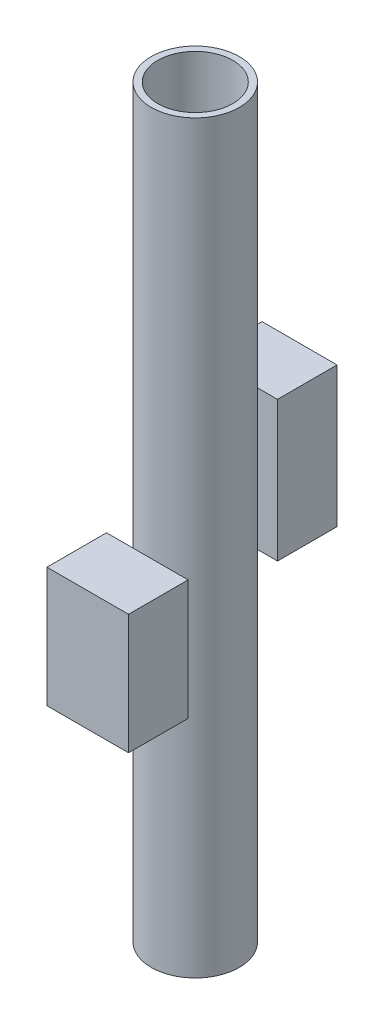
ISO-10303-21;
HEADER;
FILE_DESCRIPTION(('STEP AP214'),'2;1');
FILE_NAME('part.step','',(''),(''),'','','');
FILE_SCHEMA(('AUTOMOTIVE_DESIGN { 1 0 10303 214 1 1 1 1 }'));
ENDSEC;
DATA;
#1=APPLICATION_CONTEXT('core data for automotive mechanical design processes');
#2=APPLICATION_PROTOCOL_DEFINITION('international standard','automotive_design',2000,#1);
#3=PRODUCT_CONTEXT('',#1,'mechanical');
#4=PRODUCT('Part','Part','',(#3));
#5=PRODUCT_RELATED_PRODUCT_CATEGORY('part','',(#4));
#6=PRODUCT_DEFINITION_FORMATION('','',#4);
#7=PRODUCT_DEFINITION_CONTEXT('part definition',#1,'design');
#8=PRODUCT_DEFINITION('design','',#6,#7);
#9=PRODUCT_DEFINITION_SHAPE('','',#8);
#10=(LENGTH_UNIT() NAMED_UNIT(*) SI_UNIT(.MILLI.,.METRE.));
#11=(NAMED_UNIT(*) PLANE_ANGLE_UNIT() SI_UNIT($,.RADIAN.));
#12=(NAMED_UNIT(*) SI_UNIT($,.STERADIAN.) SOLID_ANGLE_UNIT());
#13=UNCERTAINTY_MEASURE_WITH_UNIT(LENGTH_MEASURE(1.E-05),#10,'distance_accuracy_value','');
#14=(GEOMETRIC_REPRESENTATION_CONTEXT(3) GLOBAL_UNCERTAINTY_ASSIGNED_CONTEXT((#13)) GLOBAL_UNIT_ASSIGNED_CONTEXT((#10,
#11,#12)) REPRESENTATION_CONTEXT('',''));
#15=CARTESIAN_POINT('',(0.,0.,0.));
#16=DIRECTION('',(0.,0.,1.));
#17=DIRECTION('',(1.,0.,0.));
#18=AXIS2_PLACEMENT_3D('',#15,#16,#17);
#19=CARTESIAN_POINT('',(-12.5940824496862,156.548087878033,-35.));
#20=DIRECTION('',(-1.,0.,0.));
#21=DIRECTION('',(0.,-1.,0.));
#22=AXIS2_PLACEMENT_3D('',#19,#20,#21);
#23=PLANE('',#22);
#24=DIRECTION('',(0.,-1.,0.));
#25=VECTOR('',#24,1.);
#26=CARTESIAN_POINT('',(-12.5940824496862,156.548087878033,-15.));
#27=LINE('',#26,#25);
#28=CARTESIAN_POINT('',(-12.5940824496862,156.548087878033,-15.));
#29=VERTEX_POINT('',#28);
#30=CARTESIAN_POINT('',(-12.5940824496862,109.530373673697,-15.));
#31=VERTEX_POINT('',#30);
#32=EDGE_CURVE('E108',#29,#31,#27,.T.);
#33=ORIENTED_EDGE('',*,*,#32,.F.);
#34=DIRECTION('',(0.,0.,1.));
#35=VECTOR('',#34,1.);
#36=CARTESIAN_POINT('',(-12.5940824496862,156.548087878033,-35.));
#37=LINE('',#36,#35);
#38=CARTESIAN_POINT('',(-12.5940824496862,156.548087878033,-35.));
#39=VERTEX_POINT('',#38);
#40=EDGE_CURVE('E12',#39,#29,#37,.T.);
#41=ORIENTED_EDGE('',*,*,#40,.F.);
#42=DIRECTION('',(0.,-1.,0.));
#43=VECTOR('',#42,1.);
#44=CARTESIAN_POINT('',(-12.5940824496862,156.548087878033,-35.));
#45=LINE('',#44,#43);
#46=CARTESIAN_POINT('',(-12.5940824496862,109.530373673697,-35.));
#47=VERTEX_POINT('',#46);
#48=EDGE_CURVE('E102',#39,#47,#45,.T.);
#49=ORIENTED_EDGE('',*,*,#48,.T.);
#50=DIRECTION('',(0.,0.,1.));
#51=VECTOR('',#50,1.);
#52=CARTESIAN_POINT('',(-12.5940824496862,109.530373673697,-35.));
#53=LINE('',#52,#51);
#54=EDGE_CURVE('E47',#47,#31,#53,.T.);
#55=ORIENTED_EDGE('',*,*,#54,.T.);
#56=EDGE_LOOP('',(#33,#41,#49,#55));
#57=FACE_BOUND('',#56,.T.);
#58=ADVANCED_FACE('F44',(#57),#23,.T.);
#59=CARTESIAN_POINT('',(12.5940824496862,156.548087878033,-35.));
#60=DIRECTION('',(0.,1.,0.));
#61=DIRECTION('',(0.,0.,1.));
#62=AXIS2_PLACEMENT_3D('',#59,#60,#61);
#63=PLANE('',#62);
#64=DIRECTION('',(-1.,0.,0.));
#65=VECTOR('',#64,1.);
#66=CARTESIAN_POINT('',(12.5940824496862,156.548087878033,-15.));
#67=LINE('',#66,#65);
#68=CARTESIAN_POINT('',(12.5940824496862,156.548087878033,-15.));
#69=VERTEX_POINT('',#68);
#70=EDGE_CURVE('E104',#69,#29,#67,.T.);
#71=ORIENTED_EDGE('',*,*,#70,.F.);
#72=DIRECTION('',(0.,0.,1.));
#73=VECTOR('',#72,1.);
#74=CARTESIAN_POINT('',(12.5940824496862,156.548087878033,-35.));
#75=LINE('',#74,#73);
#76=CARTESIAN_POINT('',(12.5940824496862,156.548087878033,-35.));
#77=VERTEX_POINT('',#76);
#78=EDGE_CURVE('E53',#77,#69,#75,.T.);
#79=ORIENTED_EDGE('',*,*,#78,.F.);
#80=DIRECTION('',(-1.,0.,0.));
#81=VECTOR('',#80,1.);
#82=CARTESIAN_POINT('',(12.5940824496862,156.548087878033,-35.));
#83=LINE('',#82,#81);
#84=EDGE_CURVE('E99',#77,#39,#83,.T.);
#85=ORIENTED_EDGE('',*,*,#84,.T.);
#86=ORIENTED_EDGE('',*,*,#40,.T.);
#87=EDGE_LOOP('',(#71,#79,#85,#86));
#88=FACE_BOUND('',#87,.T.);
#89=ADVANCED_FACE('F118',(#88),#63,.T.);
#90=CARTESIAN_POINT('',(12.5940824496862,109.530373673697,-35.));
#91=DIRECTION('',(1.,0.,0.));
#92=DIRECTION('',(0.,1.,0.));
#93=AXIS2_PLACEMENT_3D('',#90,#91,#92);
#94=PLANE('',#93);
#95=DIRECTION('',(0.,1.,0.));
#96=VECTOR('',#95,1.);
#97=CARTESIAN_POINT('',(12.5940824496862,109.530373673697,-15.));
#98=LINE('',#97,#96);
#99=CARTESIAN_POINT('',(12.5940824496862,109.530373673697,-15.));
#100=VERTEX_POINT('',#99);
#101=EDGE_CURVE('E94',#100,#69,#98,.T.);
#102=ORIENTED_EDGE('',*,*,#101,.F.);
#103=DIRECTION('',(0.,0.,1.));
#104=VECTOR('',#103,1.);
#105=CARTESIAN_POINT('',(12.5940824496862,109.530373673697,-35.));
#106=LINE('',#105,#104);
#107=CARTESIAN_POINT('',(12.5940824496862,109.530373673697,-35.));
#108=VERTEX_POINT('',#107);
#109=EDGE_CURVE('E89',#108,#100,#106,.T.);
#110=ORIENTED_EDGE('',*,*,#109,.F.);
#111=DIRECTION('',(0.,1.,0.));
#112=VECTOR('',#111,1.);
#113=CARTESIAN_POINT('',(12.5940824496862,109.530373673697,-35.));
#114=LINE('',#113,#112);
#115=EDGE_CURVE('E92',#108,#77,#114,.T.);
#116=ORIENTED_EDGE('',*,*,#115,.T.);
#117=ORIENTED_EDGE('',*,*,#78,.T.);
#118=EDGE_LOOP('',(#102,#110,#116,#117));
#119=FACE_BOUND('',#118,.T.);
#120=ADVANCED_FACE('F91',(#119),#94,.T.);
#121=CARTESIAN_POINT('',(-12.5940824496862,109.530373673697,-35.));
#122=DIRECTION('',(0.,-1.,0.));
#123=DIRECTION('',(0.,0.,-1.));
#124=AXIS2_PLACEMENT_3D('',#121,#122,#123);
#125=PLANE('',#124);
#126=DIRECTION('',(1.,0.,0.));
#127=VECTOR('',#126,1.);
#128=CARTESIAN_POINT('',(-12.5940824496862,109.530373673697,-15.));
#129=LINE('',#128,#127);
#130=EDGE_CURVE('E111',#31,#100,#129,.T.);
#131=ORIENTED_EDGE('',*,*,#130,.F.);
#132=ORIENTED_EDGE('',*,*,#54,.F.);
#133=DIRECTION('',(1.,0.,0.));
#134=VECTOR('',#133,1.);
#135=CARTESIAN_POINT('',(-12.5940824496862,109.530373673697,-35.));
#136=LINE('',#135,#134);
#137=EDGE_CURVE('E98',#47,#108,#136,.T.);
#138=ORIENTED_EDGE('',*,*,#137,.T.);
#139=ORIENTED_EDGE('',*,*,#109,.T.);
#140=EDGE_LOOP('',(#131,#132,#138,#139));
#141=FACE_BOUND('',#140,.T.);
#142=ADVANCED_FACE('F101',(#141),#125,.T.);
#143=CARTESIAN_POINT('',(0.,0.,-35.));
#144=DIRECTION('',(0.,0.,1.));
#145=DIRECTION('',(1.,0.,0.));
#146=AXIS2_PLACEMENT_3D('',#143,#144,#145);
#147=PLANE('',#146);
#148=ORIENTED_EDGE('',*,*,#48,.F.);
#149=ORIENTED_EDGE('',*,*,#84,.F.);
#150=ORIENTED_EDGE('',*,*,#115,.F.);
#151=ORIENTED_EDGE('',*,*,#137,.F.);
#152=EDGE_LOOP('',(#148,#149,#150,#151));
#153=FACE_BOUND('',#152,.T.);
#154=ADVANCED_FACE('F97',(#153),#147,.F.);
#155=CARTESIAN_POINT('',(0.,0.,-15.));
#156=DIRECTION('',(0.,0.,1.));
#157=DIRECTION('',(1.,0.,0.));
#158=AXIS2_PLACEMENT_3D('',#155,#156,#157);
#159=PLANE('',#158);
#160=ORIENTED_EDGE('',*,*,#32,.T.);
#161=ORIENTED_EDGE('',*,*,#130,.T.);
#162=ORIENTED_EDGE('',*,*,#101,.T.);
#163=ORIENTED_EDGE('',*,*,#70,.T.);
#164=EDGE_LOOP('',(#160,#161,#162,#163));
#165=FACE_BOUND('',#164,.T.);
#166=ADVANCED_FACE('F117',(#165),#159,.T.);
#167=CLOSED_SHELL('',(#58,#89,#120,#142,#154,#166));
#168=MANIFOLD_SOLID_BREP('B2',#167);
#169=CARTESIAN_POINT('',(-14.7872834101367,78.8043095860083,35.));
#170=DIRECTION('',(1.,0.,0.));
#171=DIRECTION('',(0.,0.,-1.));
#172=AXIS2_PLACEMENT_3D('',#169,#170,#171);
#173=PLANE('',#172);
#174=DIRECTION('',(0.,-1.,0.));
#175=VECTOR('',#174,1.);
#176=CARTESIAN_POINT('',(-14.7872834101367,78.8043095860083,15.));
#177=LINE('',#176,#175);
#178=CARTESIAN_POINT('',(-14.7872834101367,119.072475526252,15.));
#179=VERTEX_POINT('',#178);
#180=CARTESIAN_POINT('',(-14.7872834101367,78.8043095860083,15.));
#181=VERTEX_POINT('',#180);
#182=EDGE_CURVE('E238',#179,#181,#177,.T.);
#183=ORIENTED_EDGE('',*,*,#182,.T.);
#184=DIRECTION('',(0.,0.,-1.));
#185=VECTOR('',#184,1.);
#186=CARTESIAN_POINT('',(-14.7872834101367,78.8043095860083,35.));
#187=LINE('',#186,#185);
#188=CARTESIAN_POINT('',(-14.7872834101367,78.8043095860083,35.));
#189=VERTEX_POINT('',#188);
#190=EDGE_CURVE('E42',#189,#181,#187,.T.);
#191=ORIENTED_EDGE('',*,*,#190,.F.);
#192=DIRECTION('',(0.,-1.,0.));
#193=VECTOR('',#192,1.);
#194=CARTESIAN_POINT('',(-14.7872834101367,78.8043095860083,35.));
#195=LINE('',#194,#193);
#196=CARTESIAN_POINT('',(-14.7872834101367,119.072475526252,35.));
#197=VERTEX_POINT('',#196);
#198=EDGE_CURVE('E226',#197,#189,#195,.T.);
#199=ORIENTED_EDGE('',*,*,#198,.F.);
#200=DIRECTION('',(0.,0.,-1.));
#201=VECTOR('',#200,1.);
#202=CARTESIAN_POINT('',(-14.7872834101367,119.072475526252,35.));
#203=LINE('',#202,#201);
#204=EDGE_CURVE('E234',#197,#179,#203,.T.);
#205=ORIENTED_EDGE('',*,*,#204,.T.);
#206=EDGE_LOOP('',(#183,#191,#199,#205));
#207=FACE_BOUND('',#206,.T.);
#208=ADVANCED_FACE('F175',(#207),#173,.F.);
#209=CARTESIAN_POINT('',(-14.7872834101367,78.8043095860083,35.));
#210=DIRECTION('',(0.,1.,0.));
#211=DIRECTION('',(0.,0.,1.));
#212=AXIS2_PLACEMENT_3D('',#209,#210,#211);
#213=PLANE('',#212);
#214=DIRECTION('',(1.,0.,0.));
#215=VECTOR('',#214,1.);
#216=CARTESIAN_POINT('',(-14.7872834101367,78.8043095860083,15.));
#217=LINE('',#216,#215);
#218=CARTESIAN_POINT('',(12.5940824496862,78.8043095860083,15.));
#219=VERTEX_POINT('',#218);
#220=EDGE_CURVE('E230',#181,#219,#217,.T.);
#221=ORIENTED_EDGE('',*,*,#220,.T.);
#222=DIRECTION('',(0.,0.,-1.));
#223=VECTOR('',#222,1.);
#224=CARTESIAN_POINT('',(12.5940824496862,78.8043095860083,35.));
#225=LINE('',#224,#223);
#226=CARTESIAN_POINT('',(12.5940824496862,78.8043095860083,35.));
#227=VERTEX_POINT('',#226);
#228=EDGE_CURVE('E183',#227,#219,#225,.T.);
#229=ORIENTED_EDGE('',*,*,#228,.F.);
#230=DIRECTION('',(1.,0.,0.));
#231=VECTOR('',#230,1.);
#232=CARTESIAN_POINT('',(-14.7872834101367,78.8043095860083,35.));
#233=LINE('',#232,#231);
#234=EDGE_CURVE('E221',#189,#227,#233,.T.);
#235=ORIENTED_EDGE('',*,*,#234,.F.);
#236=ORIENTED_EDGE('',*,*,#190,.T.);
#237=EDGE_LOOP('',(#221,#229,#235,#236));
#238=FACE_BOUND('',#237,.T.);
#239=ADVANCED_FACE('F229',(#238),#213,.F.);
#240=CARTESIAN_POINT('',(12.5940824496862,119.072475526252,35.));
#241=DIRECTION('',(-1.,0.,0.));
#242=DIRECTION('',(0.,0.,1.));
#243=AXIS2_PLACEMENT_3D('',#240,#241,#242);
#244=PLANE('',#243);
#245=DIRECTION('',(0.,1.,0.));
#246=VECTOR('',#245,1.);
#247=CARTESIAN_POINT('',(12.5940824496862,119.072475526252,15.));
#248=LINE('',#247,#246);
#249=CARTESIAN_POINT('',(12.5940824496862,119.072475526252,15.));
#250=VERTEX_POINT('',#249);
#251=EDGE_CURVE('E208',#219,#250,#248,.T.);
#252=ORIENTED_EDGE('',*,*,#251,.T.);
#253=DIRECTION('',(0.,0.,-1.));
#254=VECTOR('',#253,1.);
#255=CARTESIAN_POINT('',(12.5940824496862,119.072475526252,35.));
#256=LINE('',#255,#254);
#257=CARTESIAN_POINT('',(12.5940824496862,119.072475526252,35.));
#258=VERTEX_POINT('',#257);
#259=EDGE_CURVE('E231',#258,#250,#256,.T.);
#260=ORIENTED_EDGE('',*,*,#259,.F.);
#261=DIRECTION('',(0.,1.,0.));
#262=VECTOR('',#261,1.);
#263=CARTESIAN_POINT('',(12.5940824496862,119.072475526252,35.));
#264=LINE('',#263,#262);
#265=EDGE_CURVE('E224',#227,#258,#264,.T.);
#266=ORIENTED_EDGE('',*,*,#265,.F.);
#267=ORIENTED_EDGE('',*,*,#228,.T.);
#268=EDGE_LOOP('',(#252,#260,#266,#267));
#269=FACE_BOUND('',#268,.T.);
#270=ADVANCED_FACE('F232',(#269),#244,.F.);
#271=CARTESIAN_POINT('',(-14.7872834101367,119.072475526252,35.));
#272=DIRECTION('',(0.,-1.,0.));
#273=DIRECTION('',(0.,0.,-1.));
#274=AXIS2_PLACEMENT_3D('',#271,#272,#273);
#275=PLANE('',#274);
#276=DIRECTION('',(-1.,0.,0.));
#277=VECTOR('',#276,1.);
#278=CARTESIAN_POINT('',(-14.7872834101367,119.072475526252,15.));
#279=LINE('',#278,#277);
#280=EDGE_CURVE('E214',#250,#179,#279,.T.);
#281=ORIENTED_EDGE('',*,*,#280,.T.);
#282=ORIENTED_EDGE('',*,*,#204,.F.);
#283=DIRECTION('',(-1.,0.,0.));
#284=VECTOR('',#283,1.);
#285=CARTESIAN_POINT('',(-14.7872834101367,119.072475526252,35.));
#286=LINE('',#285,#284);
#287=EDGE_CURVE('E191',#258,#197,#286,.T.);
#288=ORIENTED_EDGE('',*,*,#287,.F.);
#289=ORIENTED_EDGE('',*,*,#259,.T.);
#290=EDGE_LOOP('',(#281,#282,#288,#289));
#291=FACE_BOUND('',#290,.T.);
#292=ADVANCED_FACE('F245',(#291),#275,.F.);
#293=CARTESIAN_POINT('',(0.,0.,35.));
#294=DIRECTION('',(0.,0.,-1.));
#295=DIRECTION('',(-1.,0.,0.));
#296=AXIS2_PLACEMENT_3D('',#293,#294,#295);
#297=PLANE('',#296);
#298=ORIENTED_EDGE('',*,*,#198,.T.);
#299=ORIENTED_EDGE('',*,*,#234,.T.);
#300=ORIENTED_EDGE('',*,*,#265,.T.);
#301=ORIENTED_EDGE('',*,*,#287,.T.);
#302=EDGE_LOOP('',(#298,#299,#300,#301));
#303=FACE_BOUND('',#302,.T.);
#304=ADVANCED_FACE('F222',(#303),#297,.F.);
#305=CARTESIAN_POINT('',(0.,0.,15.));
#306=DIRECTION('',(0.,0.,-1.));
#307=DIRECTION('',(-1.,0.,0.));
#308=AXIS2_PLACEMENT_3D('',#305,#306,#307);
#309=PLANE('',#308);
#310=ORIENTED_EDGE('',*,*,#182,.F.);
#311=ORIENTED_EDGE('',*,*,#280,.F.);
#312=ORIENTED_EDGE('',*,*,#251,.F.);
#313=ORIENTED_EDGE('',*,*,#220,.F.);
#314=EDGE_LOOP('',(#310,#311,#312,#313));
#315=FACE_BOUND('',#314,.T.);
#316=ADVANCED_FACE('F248',(#315),#309,.T.);
#317=CLOSED_SHELL('',(#208,#239,#270,#292,#304,#316));
#318=MANIFOLD_SOLID_BREP('B6',#317);
#319=CARTESIAN_POINT('',(0.,0.,0.));
#320=DIRECTION('',(0.,1.,0.));
#321=DIRECTION('',(0.,0.,1.));
#322=AXIS2_PLACEMENT_3D('',#319,#320,#321);
#323=CYLINDRICAL_SURFACE('',#322,12.5940824496862);
#324=CARTESIAN_POINT('',(0.,0.,0.));
#325=DIRECTION('',(0.,1.,0.));
#326=DIRECTION('',(0.,0.,1.));
#327=AXIS2_PLACEMENT_3D('',#324,#325,#326);
#328=CIRCLE('',#327,12.5940824496862);
#329=CARTESIAN_POINT('',(0.,0.,12.5940824496862));
#330=VERTEX_POINT('',#329);
#331=EDGE_CURVE('E320',#330,#330,#328,.T.);
#332=ORIENTED_EDGE('',*,*,#331,.F.);
#333=EDGE_LOOP('',(#332));
#334=FACE_BOUND('',#333,.T.);
#335=CARTESIAN_POINT('',(0.,98.5,0.));
#336=DIRECTION('',(0.,1.,0.));
#337=DIRECTION('',(0.,0.,1.));
#338=AXIS2_PLACEMENT_3D('',#335,#336,#337);
#339=CIRCLE('',#338,12.5940824496862);
#340=CARTESIAN_POINT('',(0.,98.5,12.5940824496862));
#341=VERTEX_POINT('',#340);
#342=EDGE_CURVE('E174',#341,#341,#339,.F.);
#343=ORIENTED_EDGE('',*,*,#342,.F.);
#344=EDGE_LOOP('',(#343));
#345=FACE_BOUND('',#344,.T.);
#346=ADVANCED_FACE('F300',(#334,#345),#323,.F.);
#347=CARTESIAN_POINT('',(0.,250.,0.));
#348=DIRECTION('',(0.,-1.,0.));
#349=DIRECTION('',(0.,0.,-1.));
#350=AXIS2_PLACEMENT_3D('',#347,#348,#349);
#351=CYLINDRICAL_SURFACE('',#350,14.7872834101367);
#352=CARTESIAN_POINT('',(0.,250.,0.));
#353=DIRECTION('',(0.,1.,0.));
#354=DIRECTION('',(0.,0.,1.));
#355=AXIS2_PLACEMENT_3D('',#352,#353,#354);
#356=CIRCLE('',#355,14.7872834101367);
#357=CARTESIAN_POINT('',(0.,250.,14.7872834101367));
#358=VERTEX_POINT('',#357);
#359=EDGE_CURVE('E312',#358,#358,#356,.T.);
#360=ORIENTED_EDGE('',*,*,#359,.F.);
#361=EDGE_LOOP('',(#360));
#362=FACE_BOUND('',#361,.T.);
#363=CARTESIAN_POINT('',(0.,0.,0.));
#364=DIRECTION('',(0.,1.,0.));
#365=DIRECTION('',(0.,0.,1.));
#366=AXIS2_PLACEMENT_3D('',#363,#364,#365);
#367=CIRCLE('',#366,14.7872834101367);
#368=CARTESIAN_POINT('',(0.,0.,14.7872834101367));
#369=VERTEX_POINT('',#368);
#370=EDGE_CURVE('E316',#369,#369,#367,.T.);
#371=ORIENTED_EDGE('',*,*,#370,.T.);
#372=EDGE_LOOP('',(#371));
#373=FACE_BOUND('',#372,.T.);
#374=ADVANCED_FACE('F302',(#362,#373),#351,.T.);
#375=CARTESIAN_POINT('',(0.,250.,0.));
#376=DIRECTION('',(0.,1.,0.));
#377=DIRECTION('',(0.,0.,1.));
#378=AXIS2_PLACEMENT_3D('',#375,#376,#377);
#379=PLANE('',#378);
#380=CARTESIAN_POINT('',(0.,250.,0.));
#381=DIRECTION('',(0.,1.,0.));
#382=DIRECTION('',(0.,0.,1.));
#383=AXIS2_PLACEMENT_3D('',#380,#381,#382);
#384=CIRCLE('',#383,12.5940824496862);
#385=CARTESIAN_POINT('',(0.,250.,12.5940824496862));
#386=VERTEX_POINT('',#385);
#387=EDGE_CURVE('E322',#386,#386,#384,.T.);
#388=ORIENTED_EDGE('',*,*,#387,.F.);
#389=EDGE_LOOP('',(#388));
#390=FACE_BOUND('',#389,.T.);
#391=ORIENTED_EDGE('',*,*,#359,.T.);
#392=EDGE_LOOP('',(#391));
#393=FACE_BOUND('',#392,.T.);
#394=ADVANCED_FACE('F370',(#390,#393),#379,.T.);
#395=CARTESIAN_POINT('',(0.,0.,0.));
#396=DIRECTION('',(0.,1.,0.));
#397=DIRECTION('',(0.,0.,1.));
#398=AXIS2_PLACEMENT_3D('',#395,#396,#397);
#399=PLANE('',#398);
#400=ORIENTED_EDGE('',*,*,#331,.T.);
#401=EDGE_LOOP('',(#400));
#402=FACE_BOUND('',#401,.T.);
#403=ORIENTED_EDGE('',*,*,#370,.F.);
#404=EDGE_LOOP('',(#403));
#405=FACE_BOUND('',#404,.T.);
#406=ADVANCED_FACE('F350',(#402,#405),#399,.F.);
#407=CARTESIAN_POINT('',(0.,126.5,0.));
#408=DIRECTION('',(0.,1.,0.));
#409=DIRECTION('',(0.,0.,1.));
#410=AXIS2_PLACEMENT_3D('',#407,#408,#409);
#411=CIRCLE('',#410,12.5940824496862);
#412=CARTESIAN_POINT('',(0.,126.5,12.5940824496862));
#413=VERTEX_POINT('',#412);
#414=EDGE_CURVE('E325',#413,#413,#411,.T.);
#415=ORIENTED_EDGE('',*,*,#414,.F.);
#416=EDGE_LOOP('',(#415));
#417=FACE_BOUND('',#416,.T.);
#418=ORIENTED_EDGE('',*,*,#387,.T.);
#419=EDGE_LOOP('',(#418));
#420=FACE_BOUND('',#419,.T.);
#421=ADVANCED_FACE('F341',(#417,#420),#323,.F.);
#422=CARTESIAN_POINT('',(0.,126.5,0.));
#423=DIRECTION('',(0.,1.,0.));
#424=DIRECTION('',(0.,0.,1.));
#425=AXIS2_PLACEMENT_3D('',#422,#423,#424);
#426=PLANE('',#425);
#427=ORIENTED_EDGE('',*,*,#414,.T.);
#428=EDGE_LOOP('',(#427));
#429=FACE_BOUND('',#428,.T.);
#430=ADVANCED_FACE('F349',(#429),#426,.T.);
#431=CARTESIAN_POINT('',(0.,98.5,0.));
#432=DIRECTION('',(0.,1.,0.));
#433=DIRECTION('',(0.,0.,1.));
#434=AXIS2_PLACEMENT_3D('',#431,#432,#433);
#435=PLANE('',#434);
#436=ORIENTED_EDGE('',*,*,#342,.T.);
#437=EDGE_LOOP('',(#436));
#438=FACE_BOUND('',#437,.T.);
#439=ADVANCED_FACE('F360',(#438),#435,.F.);
#440=CLOSED_SHELL('',(#346,#374,#394,#406,#421,#430,#439));
#441=CARTESIAN_POINT('',(0.,101.5,0.));
#442=DIRECTION('',(0.,1.,0.));
#443=DIRECTION('',(0.,0.,1.));
#444=AXIS2_PLACEMENT_3D('',#441,#442,#443);
#445=PLANE('',#444);
#446=CARTESIAN_POINT('',(0.,101.5,0.));
#447=DIRECTION('',(0.,1.,0.));
#448=DIRECTION('',(0.,0.,1.));
#449=AXIS2_PLACEMENT_3D('',#446,#447,#448);
#450=CIRCLE('',#449,12.5940824496862);
#451=CARTESIAN_POINT('',(0.,101.5,12.5940824496862));
#452=VERTEX_POINT('',#451);
#453=EDGE_CURVE('E330',#452,#452,#450,.T.);
#454=ORIENTED_EDGE('',*,*,#453,.T.);
#455=EDGE_LOOP('',(#454));
#456=FACE_BOUND('',#455,.T.);
#457=ADVANCED_FACE('F334',(#456),#445,.T.);
#458=CARTESIAN_POINT('',(0.,123.5,0.));
#459=DIRECTION('',(0.,1.,0.));
#460=DIRECTION('',(0.,0.,1.));
#461=AXIS2_PLACEMENT_3D('',#458,#459,#460);
#462=PLANE('',#461);
#463=CARTESIAN_POINT('',(0.,123.5,0.));
#464=DIRECTION('',(0.,1.,0.));
#465=DIRECTION('',(0.,0.,1.));
#466=AXIS2_PLACEMENT_3D('',#463,#464,#465);
#467=CIRCLE('',#466,12.5940824496862);
#468=CARTESIAN_POINT('',(0.,123.5,12.5940824496862));
#469=VERTEX_POINT('',#468);
#470=EDGE_CURVE('E308',#469,#469,#467,.F.);
#471=ORIENTED_EDGE('',*,*,#470,.T.);
#472=EDGE_LOOP('',(#471));
#473=FACE_BOUND('',#472,.T.);
#474=ADVANCED_FACE('F339',(#473),#462,.F.);
#475=ORIENTED_EDGE('',*,*,#453,.F.);
#476=EDGE_LOOP('',(#475));
#477=FACE_BOUND('',#476,.T.);
#478=ORIENTED_EDGE('',*,*,#470,.F.);
#479=EDGE_LOOP('',(#478));
#480=FACE_BOUND('',#479,.T.);
#481=ADVANCED_FACE('F336',(#477,#480),#323,.F.);
#482=CLOSED_SHELL('',(#457,#474,#481));
#483=ORIENTED_CLOSED_SHELL('',*,#482,.T.);
#484=BREP_WITH_VOIDS('B36',#440,(#483));
#485=ADVANCED_BREP_SHAPE_REPRESENTATION('',(#18,#168,#318,#484),#14);
#486=SHAPE_DEFINITION_REPRESENTATION(#9,#485);
ENDSEC;
END-ISO-10303-21;
